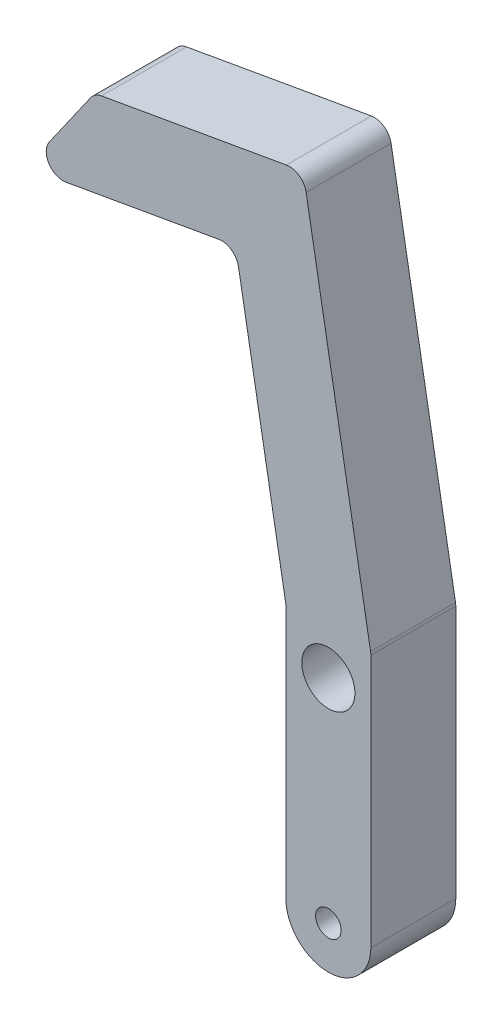
ISO-10303-21;
HEADER;
FILE_DESCRIPTION(('STEP AP214'),'2;1');
FILE_NAME('part.step','',(''),(''),'','','');
FILE_SCHEMA(('AUTOMOTIVE_DESIGN { 1 0 10303 214 1 1 1 1 }'));
ENDSEC;
DATA;
#1=APPLICATION_CONTEXT('core data for automotive mechanical design processes');
#2=APPLICATION_PROTOCOL_DEFINITION('international standard','automotive_design',2000,#1);
#3=PRODUCT_CONTEXT('',#1,'mechanical');
#4=PRODUCT('Part','Part','',(#3));
#5=PRODUCT_RELATED_PRODUCT_CATEGORY('part','',(#4));
#6=PRODUCT_DEFINITION_FORMATION('','',#4);
#7=PRODUCT_DEFINITION_CONTEXT('part definition',#1,'design');
#8=PRODUCT_DEFINITION('design','',#6,#7);
#9=PRODUCT_DEFINITION_SHAPE('','',#8);
#10=(LENGTH_UNIT() NAMED_UNIT(*) SI_UNIT(.MILLI.,.METRE.));
#11=(NAMED_UNIT(*) PLANE_ANGLE_UNIT() SI_UNIT($,.RADIAN.));
#12=(NAMED_UNIT(*) SI_UNIT($,.STERADIAN.) SOLID_ANGLE_UNIT());
#13=UNCERTAINTY_MEASURE_WITH_UNIT(LENGTH_MEASURE(1.E-05),#10,'distance_accuracy_value','');
#14=(GEOMETRIC_REPRESENTATION_CONTEXT(3) GLOBAL_UNCERTAINTY_ASSIGNED_CONTEXT((#13)) GLOBAL_UNIT_ASSIGNED_CONTEXT((#10,
#11,#12)) REPRESENTATION_CONTEXT('',''));
#15=CARTESIAN_POINT('',(0.,0.,0.));
#16=DIRECTION('',(0.,0.,1.));
#17=DIRECTION('',(1.,0.,0.));
#18=AXIS2_PLACEMENT_3D('',#15,#16,#17);
#19=CARTESIAN_POINT('',(0.,-31.75,12.7));
#20=DIRECTION('',(0.,0.,1.));
#21=DIRECTION('',(1.,0.,0.));
#22=AXIS2_PLACEMENT_3D('',#19,#20,#21);
#23=PLANE('',#22);
#24=CARTESIAN_POINT('',(0.,0.,12.7));
#25=DIRECTION('',(0.,0.,1.));
#26=DIRECTION('',(1.,0.,0.));
#27=AXIS2_PLACEMENT_3D('',#24,#25,#26);
#28=CIRCLE('',#27,3.96875);
#29=CARTESIAN_POINT('',(3.96875,0.,12.7));
#30=VERTEX_POINT('',#29);
#31=EDGE_CURVE('E241',#30,#30,#28,.T.);
#32=ORIENTED_EDGE('',*,*,#31,.F.);
#33=EDGE_LOOP('',(#32));
#34=FACE_BOUND('',#33,.T.);
#35=DIRECTION('',(-0.573576436351047,-0.819152044288991,0.));
#36=VECTOR('',#35,1.);
#37=CARTESIAN_POINT('',(-45.2398368870602,43.5087090522824,12.7));
#38=LINE('',#37,#36);
#39=CARTESIAN_POINT('',(-35.5415714532204,57.3592675004766,12.7));
#40=VERTEX_POINT('',#39);
#41=CARTESIAN_POINT('',(-41.7226074173515,48.5318333087015,12.7));
#42=VERTEX_POINT('',#41);
#43=EDGE_CURVE('E235',#40,#42,#38,.T.);
#44=ORIENTED_EDGE('',*,*,#43,.T.);
#45=CARTESIAN_POINT('',(-39.6419612248574,47.0749491603699,12.7));
#46=DIRECTION('',(0.,0.,1.));
#47=DIRECTION('',(1.,0.,0.));
#48=AXIS2_PLACEMENT_3D('',#45,#46,#47);
#49=CIRCLE('',#48,2.54);
#50=CARTESIAN_POINT('',(-39.2008948535834,44.5735374677188,12.7));
#51=VERTEX_POINT('',#50);
#52=EDGE_CURVE('E189',#42,#51,#49,.T.);
#53=ORIENTED_EDGE('',*,*,#52,.T.);
#54=DIRECTION('',(0.984807753012207,0.173648177666935,0.));
#55=VECTOR('',#54,1.);
#56=CARTESIAN_POINT('',(-13.8771855682903,49.0387906663336,12.7));
#57=LINE('',#56,#55);
#58=CARTESIAN_POINT('',(-16.3785972609414,48.5977242950596,12.7));
#59=VERTEX_POINT('',#58);
#60=EDGE_CURVE('E231',#51,#59,#57,.T.);
#61=ORIENTED_EDGE('',*,*,#60,.T.);
#62=CARTESIAN_POINT('',(-15.9375308896674,46.0963126024086,12.7));
#63=DIRECTION('',(0.,0.,1.));
#64=DIRECTION('',(1.,0.,0.));
#65=AXIS2_PLACEMENT_3D('',#62,#63,#64);
#66=CIRCLE('',#65,2.54);
#67=CARTESIAN_POINT('',(-13.4361191970163,46.5373789736826,12.7));
#68=VERTEX_POINT('',#67);
#69=EDGE_CURVE('E11',#59,#68,#66,.F.);
#70=ORIENTED_EDGE('',*,*,#69,.T.);
#71=DIRECTION('',(0.173648177666931,-0.984807753012208,0.));
#72=VECTOR('',#71,1.);
#73=CARTESIAN_POINT('',(-6.35,6.35,12.7));
#74=LINE('',#73,#72);
#75=CARTESIAN_POINT('',(-6.38858830734899,6.56884516591815,12.7));
#76=VERTEX_POINT('',#75);
#77=EDGE_CURVE('E230',#68,#76,#74,.T.);
#78=ORIENTED_EDGE('',*,*,#77,.T.);
#79=CARTESIAN_POINT('',(-8.89,6.12777879464414,12.7));
#80=DIRECTION('',(0.,0.,1.));
#81=DIRECTION('',(1.,0.,0.));
#82=AXIS2_PLACEMENT_3D('',#79,#80,#81);
#83=CIRCLE('',#82,2.54);
#84=CARTESIAN_POINT('',(-6.35,6.12777879464413,12.7));
#85=VERTEX_POINT('',#84);
#86=EDGE_CURVE('E48',#76,#85,#83,.F.);
#87=ORIENTED_EDGE('',*,*,#86,.T.);
#88=DIRECTION('',(0.,-1.,0.));
#89=VECTOR('',#88,1.);
#90=CARTESIAN_POINT('',(-6.35,-31.75,12.7));
#91=LINE('',#90,#89);
#92=CARTESIAN_POINT('',(-6.35,-31.75,12.7));
#93=VERTEX_POINT('',#92);
#94=EDGE_CURVE('E151',#85,#93,#91,.T.);
#95=ORIENTED_EDGE('',*,*,#94,.T.);
#96=CARTESIAN_POINT('',(0.,-31.75,12.7));
#97=DIRECTION('',(0.,0.,1.));
#98=DIRECTION('',(1.,0.,0.));
#99=AXIS2_PLACEMENT_3D('',#96,#97,#98);
#100=CIRCLE('',#99,6.35);
#101=CARTESIAN_POINT('',(6.35,-31.75,12.7));
#102=VERTEX_POINT('',#101);
#103=EDGE_CURVE('E146',#93,#102,#100,.T.);
#104=ORIENTED_EDGE('',*,*,#103,.T.);
#105=DIRECTION('',(0.,1.,0.));
#106=VECTOR('',#105,1.);
#107=CARTESIAN_POINT('',(6.35,-31.75,12.7));
#108=LINE('',#107,#106);
#109=CARTESIAN_POINT('',(6.35,6.12777879464414,12.7));
#110=VERTEX_POINT('',#109);
#111=EDGE_CURVE('E135',#102,#110,#108,.T.);
#112=ORIENTED_EDGE('',*,*,#111,.T.);
#113=CARTESIAN_POINT('',(3.81,6.12777879464415,12.7));
#114=DIRECTION('',(0.,0.,1.));
#115=DIRECTION('',(1.,0.,0.));
#116=AXIS2_PLACEMENT_3D('',#113,#114,#115);
#117=CIRCLE('',#116,2.54);
#118=CARTESIAN_POINT('',(6.31141169265101,6.56884516591816,12.7));
#119=VERTEX_POINT('',#118);
#120=EDGE_CURVE('E183',#110,#119,#117,.T.);
#121=ORIENTED_EDGE('',*,*,#120,.T.);
#122=DIRECTION('',(-0.173648177666931,0.984807753012208,0.));
#123=VECTOR('',#122,1.);
#124=CARTESIAN_POINT('',(-3.76546928266988,63.7176770397067,12.7));
#125=LINE('',#124,#123);
#126=CARTESIAN_POINT('',(-3.32440291139587,61.2162653470557,12.7));
#127=VERTEX_POINT('',#126);
#128=EDGE_CURVE('E145',#119,#127,#125,.T.);
#129=ORIENTED_EDGE('',*,*,#128,.T.);
#130=CARTESIAN_POINT('',(-5.82581460404688,60.7751989757817,12.7));
#131=DIRECTION('',(0.,0.,1.));
#132=DIRECTION('',(1.,0.,0.));
#133=AXIS2_PLACEMENT_3D('',#130,#131,#132);
#134=CIRCLE('',#133,2.54);
#135=CARTESIAN_POINT('',(-6.2668809753209,63.2766106684327,12.7));
#136=VERTEX_POINT('',#135);
#137=EDGE_CURVE('E185',#127,#136,#134,.T.);
#138=ORIENTED_EDGE('',*,*,#137,.T.);
#139=DIRECTION('',(-0.984807753012207,-0.173648177666935,0.));
#140=VECTOR('',#139,1.);
#141=CARTESIAN_POINT('',(-34.9381102801751,58.2210993719075,12.7));
#142=LINE('',#141,#140);
#143=CARTESIAN_POINT('',(-33.9019916320004,58.4037950447959,12.7));
#144=VERTEX_POINT('',#143);
#145=EDGE_CURVE('E265',#136,#144,#142,.T.);
#146=ORIENTED_EDGE('',*,*,#145,.T.);
#147=CARTESIAN_POINT('',(-33.4609252607264,55.9023833521449,12.7));
#148=DIRECTION('',(0.,0.,1.));
#149=DIRECTION('',(1.,0.,0.));
#150=AXIS2_PLACEMENT_3D('',#147,#148,#149);
#151=CIRCLE('',#150,2.54);
#152=EDGE_CURVE('E187',#144,#40,#151,.T.);
#153=ORIENTED_EDGE('',*,*,#152,.T.);
#154=EDGE_LOOP('',(#44,#53,#61,#70,#78,#87,#95,#104,#112,#121,#129,#138,#146,#153));
#155=FACE_BOUND('',#154,.T.);
#156=CARTESIAN_POINT('',(0.,-31.75,12.7));
#157=DIRECTION('',(0.,0.,1.));
#158=DIRECTION('',(1.,0.,0.));
#159=AXIS2_PLACEMENT_3D('',#156,#157,#158);
#160=CIRCLE('',#159,1.905);
#161=CARTESIAN_POINT('',(1.905,-31.75,12.7));
#162=VERTEX_POINT('',#161);
#163=EDGE_CURVE('E339',#162,#162,#160,.T.);
#164=ORIENTED_EDGE('',*,*,#163,.F.);
#165=EDGE_LOOP('',(#164));
#166=FACE_BOUND('',#165,.T.);
#167=ADVANCED_FACE('F33',(#34,#155,#166),#23,.T.);
#168=CARTESIAN_POINT('',(0.,-31.75,0.));
#169=DIRECTION('',(0.,0.,1.));
#170=DIRECTION('',(1.,0.,0.));
#171=AXIS2_PLACEMENT_3D('',#168,#169,#170);
#172=PLANE('',#171);
#173=DIRECTION('',(0.984807753012207,0.173648177666935,0.));
#174=VECTOR('',#173,1.);
#175=CARTESIAN_POINT('',(-13.8771855682903,49.0387906663336,0.));
#176=LINE('',#175,#174);
#177=CARTESIAN_POINT('',(-39.2008948535834,44.5735374677188,0.));
#178=VERTEX_POINT('',#177);
#179=CARTESIAN_POINT('',(-16.3785972609414,48.5977242950596,0.));
#180=VERTEX_POINT('',#179);
#181=EDGE_CURVE('E217',#178,#180,#176,.T.);
#182=ORIENTED_EDGE('',*,*,#181,.F.);
#183=CARTESIAN_POINT('',(-39.6419612248574,47.0749491603699,0.));
#184=DIRECTION('',(0.,0.,1.));
#185=DIRECTION('',(1.,0.,0.));
#186=AXIS2_PLACEMENT_3D('',#183,#184,#185);
#187=CIRCLE('',#186,2.54);
#188=CARTESIAN_POINT('',(-41.7226074173515,48.5318333087015,0.));
#189=VERTEX_POINT('',#188);
#190=EDGE_CURVE('E176',#178,#189,#187,.F.);
#191=ORIENTED_EDGE('',*,*,#190,.T.);
#192=DIRECTION('',(-0.573576436351047,-0.819152044288991,0.));
#193=VECTOR('',#192,1.);
#194=CARTESIAN_POINT('',(-45.2398368870602,43.5087090522824,0.));
#195=LINE('',#194,#193);
#196=CARTESIAN_POINT('',(-35.5415714532204,57.3592675004766,0.));
#197=VERTEX_POINT('',#196);
#198=EDGE_CURVE('E227',#197,#189,#195,.T.);
#199=ORIENTED_EDGE('',*,*,#198,.F.);
#200=CARTESIAN_POINT('',(-33.4609252607264,55.9023833521449,0.));
#201=DIRECTION('',(0.,0.,1.));
#202=DIRECTION('',(1.,0.,0.));
#203=AXIS2_PLACEMENT_3D('',#200,#201,#202);
#204=CIRCLE('',#203,2.54);
#205=CARTESIAN_POINT('',(-33.9019916320004,58.4037950447959,0.));
#206=VERTEX_POINT('',#205);
#207=EDGE_CURVE('E174',#197,#206,#204,.F.);
#208=ORIENTED_EDGE('',*,*,#207,.T.);
#209=DIRECTION('',(-0.984807753012207,-0.173648177666935,0.));
#210=VECTOR('',#209,1.);
#211=CARTESIAN_POINT('',(-34.9381102801751,58.2210993719075,0.));
#212=LINE('',#211,#210);
#213=CARTESIAN_POINT('',(-6.2668809753209,63.2766106684327,0.));
#214=VERTEX_POINT('',#213);
#215=EDGE_CURVE('E246',#214,#206,#212,.T.);
#216=ORIENTED_EDGE('',*,*,#215,.F.);
#217=CARTESIAN_POINT('',(-5.82581460404688,60.7751989757817,0.));
#218=DIRECTION('',(0.,0.,1.));
#219=DIRECTION('',(1.,0.,0.));
#220=AXIS2_PLACEMENT_3D('',#217,#218,#219);
#221=CIRCLE('',#220,2.54);
#222=CARTESIAN_POINT('',(-3.32440291139587,61.2162653470557,0.));
#223=VERTEX_POINT('',#222);
#224=EDGE_CURVE('E172',#214,#223,#221,.F.);
#225=ORIENTED_EDGE('',*,*,#224,.T.);
#226=DIRECTION('',(-0.173648177666931,0.984807753012208,0.));
#227=VECTOR('',#226,1.);
#228=CARTESIAN_POINT('',(-3.76546928266988,63.7176770397067,0.));
#229=LINE('',#228,#227);
#230=CARTESIAN_POINT('',(6.31141169265101,6.56884516591816,0.));
#231=VERTEX_POINT('',#230);
#232=EDGE_CURVE('E243',#231,#223,#229,.T.);
#233=ORIENTED_EDGE('',*,*,#232,.F.);
#234=CARTESIAN_POINT('',(3.81,6.12777879464415,0.));
#235=DIRECTION('',(0.,0.,1.));
#236=DIRECTION('',(1.,0.,0.));
#237=AXIS2_PLACEMENT_3D('',#234,#235,#236);
#238=CIRCLE('',#237,2.54);
#239=CARTESIAN_POINT('',(6.35,6.12777879464414,0.));
#240=VERTEX_POINT('',#239);
#241=EDGE_CURVE('E170',#231,#240,#238,.F.);
#242=ORIENTED_EDGE('',*,*,#241,.T.);
#243=DIRECTION('',(0.,1.,0.));
#244=VECTOR('',#243,1.);
#245=CARTESIAN_POINT('',(6.35,-31.75,0.));
#246=LINE('',#245,#244);
#247=CARTESIAN_POINT('',(6.35,-31.75,0.));
#248=VERTEX_POINT('',#247);
#249=EDGE_CURVE('E240',#248,#240,#246,.T.);
#250=ORIENTED_EDGE('',*,*,#249,.F.);
#251=CARTESIAN_POINT('',(0.,-31.75,0.));
#252=DIRECTION('',(0.,0.,1.));
#253=DIRECTION('',(1.,0.,0.));
#254=AXIS2_PLACEMENT_3D('',#251,#252,#253);
#255=CIRCLE('',#254,6.35);
#256=CARTESIAN_POINT('',(-6.35,-31.75,0.));
#257=VERTEX_POINT('',#256);
#258=EDGE_CURVE('E159',#257,#248,#255,.T.);
#259=ORIENTED_EDGE('',*,*,#258,.F.);
#260=DIRECTION('',(0.,-1.,0.));
#261=VECTOR('',#260,1.);
#262=CARTESIAN_POINT('',(-6.35,-31.75,0.));
#263=LINE('',#262,#261);
#264=CARTESIAN_POINT('',(-6.35,6.12777879464413,0.));
#265=VERTEX_POINT('',#264);
#266=EDGE_CURVE('E155',#265,#257,#263,.T.);
#267=ORIENTED_EDGE('',*,*,#266,.F.);
#268=CARTESIAN_POINT('',(-8.89,6.12777879464414,0.));
#269=DIRECTION('',(0.,0.,1.));
#270=DIRECTION('',(1.,0.,0.));
#271=AXIS2_PLACEMENT_3D('',#268,#269,#270);
#272=CIRCLE('',#271,2.54);
#273=CARTESIAN_POINT('',(-6.38858830734899,6.56884516591815,0.));
#274=VERTEX_POINT('',#273);
#275=EDGE_CURVE('E209',#265,#274,#272,.T.);
#276=ORIENTED_EDGE('',*,*,#275,.T.);
#277=DIRECTION('',(0.173648177666931,-0.984807753012208,0.));
#278=VECTOR('',#277,1.);
#279=CARTESIAN_POINT('',(-6.35,6.35,0.));
#280=LINE('',#279,#278);
#281=CARTESIAN_POINT('',(-13.4361191970163,46.5373789736826,0.));
#282=VERTEX_POINT('',#281);
#283=EDGE_CURVE('E218',#282,#274,#280,.T.);
#284=ORIENTED_EDGE('',*,*,#283,.F.);
#285=CARTESIAN_POINT('',(-15.9375308896674,46.0963126024086,0.));
#286=DIRECTION('',(0.,0.,1.));
#287=DIRECTION('',(1.,0.,0.));
#288=AXIS2_PLACEMENT_3D('',#285,#286,#287);
#289=CIRCLE('',#288,2.54);
#290=EDGE_CURVE('E41',#282,#180,#289,.T.);
#291=ORIENTED_EDGE('',*,*,#290,.T.);
#292=EDGE_LOOP('',(#182,#191,#199,#208,#216,#225,#233,#242,#250,#259,#267,#276,#284,#291));
#293=FACE_BOUND('',#292,.T.);
#294=CARTESIAN_POINT('',(0.,0.,0.));
#295=DIRECTION('',(0.,0.,1.));
#296=DIRECTION('',(1.,0.,0.));
#297=AXIS2_PLACEMENT_3D('',#294,#295,#296);
#298=CIRCLE('',#297,3.96875);
#299=CARTESIAN_POINT('',(3.96875,0.,0.));
#300=VERTEX_POINT('',#299);
#301=EDGE_CURVE('E345',#300,#300,#298,.T.);
#302=ORIENTED_EDGE('',*,*,#301,.T.);
#303=EDGE_LOOP('',(#302));
#304=FACE_BOUND('',#303,.T.);
#305=CARTESIAN_POINT('',(0.,-31.75,0.));
#306=DIRECTION('',(0.,0.,1.));
#307=DIRECTION('',(1.,0.,0.));
#308=AXIS2_PLACEMENT_3D('',#305,#306,#307);
#309=CIRCLE('',#308,1.905);
#310=CARTESIAN_POINT('',(1.905,-31.75,0.));
#311=VERTEX_POINT('',#310);
#312=EDGE_CURVE('E342',#311,#311,#309,.T.);
#313=ORIENTED_EDGE('',*,*,#312,.T.);
#314=EDGE_LOOP('',(#313));
#315=FACE_BOUND('',#314,.T.);
#316=ADVANCED_FACE('F215',(#293,#304,#315),#172,.F.);
#317=CARTESIAN_POINT('',(0.,-31.75,12.7));
#318=DIRECTION('',(0.,0.,-1.));
#319=DIRECTION('',(-1.,0.,0.));
#320=AXIS2_PLACEMENT_3D('',#317,#318,#319);
#321=CYLINDRICAL_SURFACE('',#320,6.35);
#322=ORIENTED_EDGE('',*,*,#258,.T.);
#323=DIRECTION('',(0.,0.,-1.));
#324=VECTOR('',#323,1.);
#325=CARTESIAN_POINT('',(6.35,-31.75,12.7));
#326=LINE('',#325,#324);
#327=EDGE_CURVE('E140',#102,#248,#326,.T.);
#328=ORIENTED_EDGE('',*,*,#327,.F.);
#329=ORIENTED_EDGE('',*,*,#103,.F.);
#330=DIRECTION('',(0.,0.,-1.));
#331=VECTOR('',#330,1.);
#332=CARTESIAN_POINT('',(-6.35,-31.75,12.7));
#333=LINE('',#332,#331);
#334=EDGE_CURVE('E161',#93,#257,#333,.T.);
#335=ORIENTED_EDGE('',*,*,#334,.T.);
#336=EDGE_LOOP('',(#322,#328,#329,#335));
#337=FACE_BOUND('',#336,.T.);
#338=ADVANCED_FACE('F157',(#337),#321,.T.);
#339=CARTESIAN_POINT('',(6.35,-31.75,12.7));
#340=DIRECTION('',(-1.,0.,0.));
#341=DIRECTION('',(0.,0.,1.));
#342=AXIS2_PLACEMENT_3D('',#339,#340,#341);
#343=PLANE('',#342);
#344=ORIENTED_EDGE('',*,*,#249,.T.);
#345=DIRECTION('',(0.,0.,-1.));
#346=VECTOR('',#345,1.);
#347=CARTESIAN_POINT('',(6.35,6.12777879464415,12.7));
#348=LINE('',#347,#346);
#349=EDGE_CURVE('E143',#240,#110,#348,.F.);
#350=ORIENTED_EDGE('',*,*,#349,.T.);
#351=ORIENTED_EDGE('',*,*,#111,.F.);
#352=ORIENTED_EDGE('',*,*,#327,.T.);
#353=EDGE_LOOP('',(#344,#350,#351,#352));
#354=FACE_BOUND('',#353,.T.);
#355=ADVANCED_FACE('F138',(#354),#343,.F.);
#356=CARTESIAN_POINT('',(-3.76546928266988,63.7176770397067,12.7));
#357=DIRECTION('',(-0.984807753012208,-0.173648177666931,0.));
#358=DIRECTION('',(0.173648177666931,-0.984807753012208,0.));
#359=AXIS2_PLACEMENT_3D('',#356,#357,#358);
#360=PLANE('',#359);
#361=ORIENTED_EDGE('',*,*,#232,.T.);
#362=DIRECTION('',(0.,0.,-1.));
#363=VECTOR('',#362,1.);
#364=CARTESIAN_POINT('',(-3.32440291139587,61.2162653470557,12.7));
#365=LINE('',#364,#363);
#366=EDGE_CURVE('E199',#223,#127,#365,.F.);
#367=ORIENTED_EDGE('',*,*,#366,.T.);
#368=ORIENTED_EDGE('',*,*,#128,.F.);
#369=DIRECTION('',(0.,0.,-1.));
#370=VECTOR('',#369,1.);
#371=CARTESIAN_POINT('',(6.31141169265101,6.56884516591816,12.7));
#372=LINE('',#371,#370);
#373=EDGE_CURVE('E196',#119,#231,#372,.T.);
#374=ORIENTED_EDGE('',*,*,#373,.T.);
#375=EDGE_LOOP('',(#361,#367,#368,#374));
#376=FACE_BOUND('',#375,.T.);
#377=ADVANCED_FACE('F263',(#376),#360,.F.);
#378=CARTESIAN_POINT('',(-34.9381102801751,58.2210993719075,12.7));
#379=DIRECTION('',(0.173648177666935,-0.984807753012207,0.));
#380=DIRECTION('',(0.984807753012207,0.173648177666935,0.));
#381=AXIS2_PLACEMENT_3D('',#378,#379,#380);
#382=PLANE('',#381);
#383=ORIENTED_EDGE('',*,*,#215,.T.);
#384=DIRECTION('',(0.,0.,-1.));
#385=VECTOR('',#384,1.);
#386=CARTESIAN_POINT('',(-33.9019916320004,58.4037950447959,12.7));
#387=LINE('',#386,#385);
#388=EDGE_CURVE('E194',#206,#144,#387,.F.);
#389=ORIENTED_EDGE('',*,*,#388,.T.);
#390=ORIENTED_EDGE('',*,*,#145,.F.);
#391=DIRECTION('',(0.,0.,-1.));
#392=VECTOR('',#391,1.);
#393=CARTESIAN_POINT('',(-6.26688097532089,63.2766106684327,12.7));
#394=LINE('',#393,#392);
#395=EDGE_CURVE('E191',#136,#214,#394,.T.);
#396=ORIENTED_EDGE('',*,*,#395,.T.);
#397=EDGE_LOOP('',(#383,#389,#390,#396));
#398=FACE_BOUND('',#397,.T.);
#399=ADVANCED_FACE('F284',(#398),#382,.F.);
#400=CARTESIAN_POINT('',(-45.2398368870602,43.5087090522824,12.7));
#401=DIRECTION('',(0.819152044288991,-0.573576436351047,0.));
#402=DIRECTION('',(0.573576436351047,0.819152044288992,0.));
#403=AXIS2_PLACEMENT_3D('',#400,#401,#402);
#404=PLANE('',#403);
#405=ORIENTED_EDGE('',*,*,#198,.T.);
#406=DIRECTION('',(0.,0.,-1.));
#407=VECTOR('',#406,1.);
#408=CARTESIAN_POINT('',(-41.7226074173515,48.5318333087015,12.7));
#409=LINE('',#408,#407);
#410=EDGE_CURVE('E181',#189,#42,#409,.F.);
#411=ORIENTED_EDGE('',*,*,#410,.T.);
#412=ORIENTED_EDGE('',*,*,#43,.F.);
#413=DIRECTION('',(0.,0.,-1.));
#414=VECTOR('',#413,1.);
#415=CARTESIAN_POINT('',(-35.5415714532204,57.3592675004766,12.7));
#416=LINE('',#415,#414);
#417=EDGE_CURVE('E178',#40,#197,#416,.T.);
#418=ORIENTED_EDGE('',*,*,#417,.T.);
#419=EDGE_LOOP('',(#405,#411,#412,#418));
#420=FACE_BOUND('',#419,.T.);
#421=ADVANCED_FACE('F278',(#420),#404,.F.);
#422=CARTESIAN_POINT('',(-13.8771855682903,49.0387906663336,12.7));
#423=DIRECTION('',(-0.173648177666935,0.984807753012207,0.));
#424=DIRECTION('',(-0.984807753012207,-0.173648177666935,0.));
#425=AXIS2_PLACEMENT_3D('',#422,#423,#424);
#426=PLANE('',#425);
#427=ORIENTED_EDGE('',*,*,#60,.F.);
#428=DIRECTION('',(0.,0.,-1.));
#429=VECTOR('',#428,1.);
#430=CARTESIAN_POINT('',(-39.2008948535834,44.5735374677188,12.7));
#431=LINE('',#430,#429);
#432=EDGE_CURVE('E163',#51,#178,#431,.T.);
#433=ORIENTED_EDGE('',*,*,#432,.T.);
#434=ORIENTED_EDGE('',*,*,#181,.T.);
#435=DIRECTION('',(0.,0.,-1.));
#436=VECTOR('',#435,1.);
#437=CARTESIAN_POINT('',(-16.3785972609414,48.5977242950596,12.7));
#438=LINE('',#437,#436);
#439=EDGE_CURVE('E160',#180,#59,#438,.F.);
#440=ORIENTED_EDGE('',*,*,#439,.T.);
#441=EDGE_LOOP('',(#427,#433,#434,#440));
#442=FACE_BOUND('',#441,.T.);
#443=ADVANCED_FACE('F224',(#442),#426,.F.);
#444=CARTESIAN_POINT('',(-6.35,6.35,12.7));
#445=DIRECTION('',(0.984807753012208,0.173648177666931,0.));
#446=DIRECTION('',(-0.173648177666931,0.984807753012208,0.));
#447=AXIS2_PLACEMENT_3D('',#444,#445,#446);
#448=PLANE('',#447);
#449=ORIENTED_EDGE('',*,*,#283,.T.);
#450=DIRECTION('',(0.,0.,-1.));
#451=VECTOR('',#450,1.);
#452=CARTESIAN_POINT('',(-6.38858830734899,6.56884516591815,12.7));
#453=LINE('',#452,#451);
#454=EDGE_CURVE('E56',#274,#76,#453,.F.);
#455=ORIENTED_EDGE('',*,*,#454,.T.);
#456=ORIENTED_EDGE('',*,*,#77,.F.);
#457=DIRECTION('',(0.,0.,-1.));
#458=VECTOR('',#457,1.);
#459=CARTESIAN_POINT('',(-13.4361191970163,46.5373789736826,0.));
#460=LINE('',#459,#458);
#461=EDGE_CURVE('E205',#68,#282,#460,.T.);
#462=ORIENTED_EDGE('',*,*,#461,.T.);
#463=EDGE_LOOP('',(#449,#455,#456,#462));
#464=FACE_BOUND('',#463,.T.);
#465=ADVANCED_FACE('F232',(#464),#448,.F.);
#466=CARTESIAN_POINT('',(-6.35,-31.75,12.7));
#467=DIRECTION('',(1.,0.,0.));
#468=DIRECTION('',(0.,1.,0.));
#469=AXIS2_PLACEMENT_3D('',#466,#467,#468);
#470=PLANE('',#469);
#471=ORIENTED_EDGE('',*,*,#94,.F.);
#472=DIRECTION('',(0.,0.,-1.));
#473=VECTOR('',#472,1.);
#474=CARTESIAN_POINT('',(-6.35,6.12777879464414,0.));
#475=LINE('',#474,#473);
#476=EDGE_CURVE('E202',#85,#265,#475,.T.);
#477=ORIENTED_EDGE('',*,*,#476,.T.);
#478=ORIENTED_EDGE('',*,*,#266,.T.);
#479=ORIENTED_EDGE('',*,*,#334,.F.);
#480=EDGE_LOOP('',(#471,#477,#478,#479));
#481=FACE_BOUND('',#480,.T.);
#482=ADVANCED_FACE('F253',(#481),#470,.F.);
#483=CARTESIAN_POINT('',(0.,0.,12.7));
#484=DIRECTION('',(0.,0.,-1.));
#485=DIRECTION('',(-1.,0.,0.));
#486=AXIS2_PLACEMENT_3D('',#483,#484,#485);
#487=CYLINDRICAL_SURFACE('',#486,3.96875);
#488=ORIENTED_EDGE('',*,*,#31,.T.);
#489=EDGE_LOOP('',(#488));
#490=FACE_BOUND('',#489,.T.);
#491=ORIENTED_EDGE('',*,*,#301,.F.);
#492=EDGE_LOOP('',(#491));
#493=FACE_BOUND('',#492,.T.);
#494=ADVANCED_FACE('F307',(#490,#493),#487,.F.);
#495=CARTESIAN_POINT('',(0.,-31.75,12.7));
#496=DIRECTION('',(0.,0.,-1.));
#497=DIRECTION('',(-1.,0.,0.));
#498=AXIS2_PLACEMENT_3D('',#495,#496,#497);
#499=CYLINDRICAL_SURFACE('',#498,1.905);
#500=ORIENTED_EDGE('',*,*,#163,.T.);
#501=EDGE_LOOP('',(#500));
#502=FACE_BOUND('',#501,.T.);
#503=ORIENTED_EDGE('',*,*,#312,.F.);
#504=EDGE_LOOP('',(#503));
#505=FACE_BOUND('',#504,.T.);
#506=ADVANCED_FACE('F327',(#502,#505),#499,.F.);
#507=CARTESIAN_POINT('',(-39.6419612248574,47.0749491603699,12.7));
#508=DIRECTION('',(0.,0.,-1.));
#509=DIRECTION('',(-1.,0.,0.));
#510=AXIS2_PLACEMENT_3D('',#507,#508,#509);
#511=CYLINDRICAL_SURFACE('',#510,2.54);
#512=ORIENTED_EDGE('',*,*,#52,.F.);
#513=ORIENTED_EDGE('',*,*,#410,.F.);
#514=ORIENTED_EDGE('',*,*,#190,.F.);
#515=ORIENTED_EDGE('',*,*,#432,.F.);
#516=EDGE_LOOP('',(#512,#513,#514,#515));
#517=FACE_BOUND('',#516,.T.);
#518=ADVANCED_FACE('F276',(#517),#511,.T.);
#519=CARTESIAN_POINT('',(-33.4609252607264,55.9023833521449,12.7));
#520=DIRECTION('',(0.,0.,-1.));
#521=DIRECTION('',(-1.,0.,0.));
#522=AXIS2_PLACEMENT_3D('',#519,#520,#521);
#523=CYLINDRICAL_SURFACE('',#522,2.54);
#524=ORIENTED_EDGE('',*,*,#152,.F.);
#525=ORIENTED_EDGE('',*,*,#388,.F.);
#526=ORIENTED_EDGE('',*,*,#207,.F.);
#527=ORIENTED_EDGE('',*,*,#417,.F.);
#528=EDGE_LOOP('',(#524,#525,#526,#527));
#529=FACE_BOUND('',#528,.T.);
#530=ADVANCED_FACE('F280',(#529),#523,.T.);
#531=CARTESIAN_POINT('',(-5.82581460404688,60.7751989757817,12.7));
#532=DIRECTION('',(0.,0.,-1.));
#533=DIRECTION('',(-1.,0.,0.));
#534=AXIS2_PLACEMENT_3D('',#531,#532,#533);
#535=CYLINDRICAL_SURFACE('',#534,2.54);
#536=ORIENTED_EDGE('',*,*,#137,.F.);
#537=ORIENTED_EDGE('',*,*,#366,.F.);
#538=ORIENTED_EDGE('',*,*,#224,.F.);
#539=ORIENTED_EDGE('',*,*,#395,.F.);
#540=EDGE_LOOP('',(#536,#537,#538,#539));
#541=FACE_BOUND('',#540,.T.);
#542=ADVANCED_FACE('F288',(#541),#535,.T.);
#543=CARTESIAN_POINT('',(3.81,6.12777879464415,12.7));
#544=DIRECTION('',(0.,0.,-1.));
#545=DIRECTION('',(-1.,0.,0.));
#546=AXIS2_PLACEMENT_3D('',#543,#544,#545);
#547=CYLINDRICAL_SURFACE('',#546,2.54);
#548=ORIENTED_EDGE('',*,*,#120,.F.);
#549=ORIENTED_EDGE('',*,*,#349,.F.);
#550=ORIENTED_EDGE('',*,*,#241,.F.);
#551=ORIENTED_EDGE('',*,*,#373,.F.);
#552=EDGE_LOOP('',(#548,#549,#550,#551));
#553=FACE_BOUND('',#552,.T.);
#554=ADVANCED_FACE('F257',(#553),#547,.T.);
#555=CARTESIAN_POINT('',(-8.89,6.12777879464414,12.7));
#556=DIRECTION('',(0.,0.,1.));
#557=DIRECTION('',(1.,0.,0.));
#558=AXIS2_PLACEMENT_3D('',#555,#556,#557);
#559=CYLINDRICAL_SURFACE('',#558,2.54);
#560=ORIENTED_EDGE('',*,*,#86,.F.);
#561=ORIENTED_EDGE('',*,*,#454,.F.);
#562=ORIENTED_EDGE('',*,*,#275,.F.);
#563=ORIENTED_EDGE('',*,*,#476,.F.);
#564=EDGE_LOOP('',(#560,#561,#562,#563));
#565=FACE_BOUND('',#564,.T.);
#566=ADVANCED_FACE('F295',(#565),#559,.F.);
#567=CARTESIAN_POINT('',(-15.9375308896674,46.0963126024086,12.7));
#568=DIRECTION('',(0.,0.,1.));
#569=DIRECTION('',(1.,0.,0.));
#570=AXIS2_PLACEMENT_3D('',#567,#568,#569);
#571=CYLINDRICAL_SURFACE('',#570,2.54);
#572=ORIENTED_EDGE('',*,*,#69,.F.);
#573=ORIENTED_EDGE('',*,*,#439,.F.);
#574=ORIENTED_EDGE('',*,*,#290,.F.);
#575=ORIENTED_EDGE('',*,*,#461,.F.);
#576=EDGE_LOOP('',(#572,#573,#574,#575));
#577=FACE_BOUND('',#576,.T.);
#578=ADVANCED_FACE('F35',(#577),#571,.F.);
#579=CLOSED_SHELL('',(#167,#316,#338,#355,#377,#399,#421,#443,#465,#482,#494,#506,#518,#530,
#542,#554,#566,#578));
#580=MANIFOLD_SOLID_BREP('B2',#579);
#581=ADVANCED_BREP_SHAPE_REPRESENTATION('',(#18,#580),#14);
#582=SHAPE_DEFINITION_REPRESENTATION(#9,#581);
ENDSEC;
END-ISO-10303-21;
